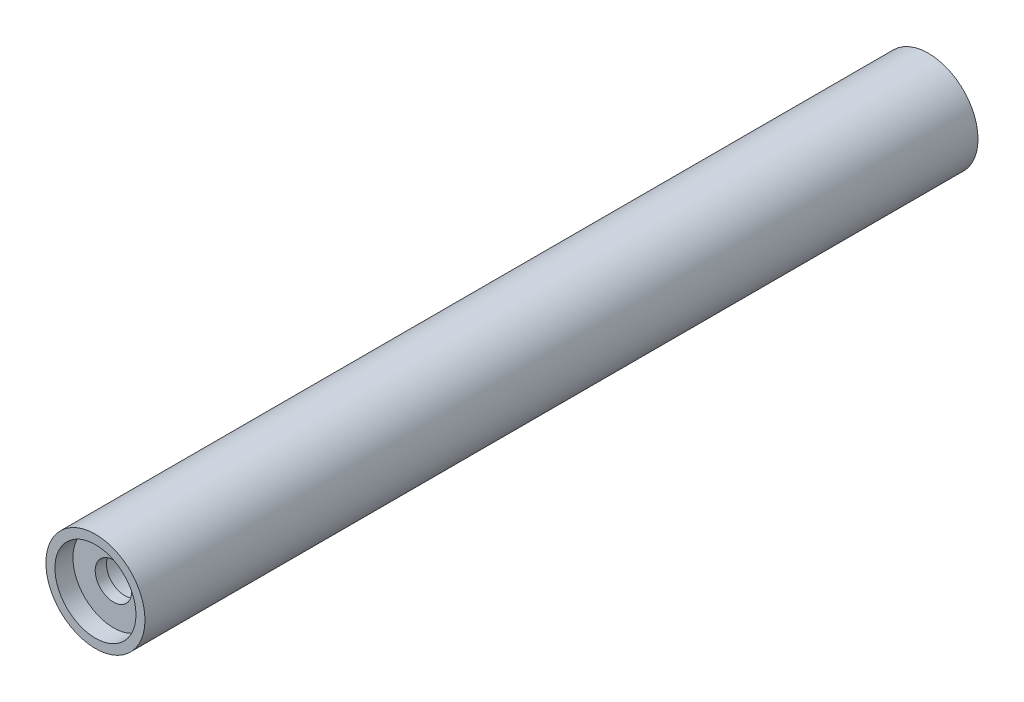
ISO-10303-21;
HEADER;
FILE_DESCRIPTION(('STEP AP214'),'2;1');
FILE_NAME('part.step','',(''),(''),'','','');
FILE_SCHEMA(('AUTOMOTIVE_DESIGN { 1 0 10303 214 1 1 1 1 }'));
ENDSEC;
DATA;
#1=APPLICATION_CONTEXT('core data for automotive mechanical design processes');
#2=APPLICATION_PROTOCOL_DEFINITION('international standard','automotive_design',2000,#1);
#3=PRODUCT_CONTEXT('',#1,'mechanical');
#4=PRODUCT('Part','Part','',(#3));
#5=PRODUCT_RELATED_PRODUCT_CATEGORY('part','',(#4));
#6=PRODUCT_DEFINITION_FORMATION('','',#4);
#7=PRODUCT_DEFINITION_CONTEXT('part definition',#1,'design');
#8=PRODUCT_DEFINITION('design','',#6,#7);
#9=PRODUCT_DEFINITION_SHAPE('','',#8);
#10=(LENGTH_UNIT() NAMED_UNIT(*) SI_UNIT(.MILLI.,.METRE.));
#11=(NAMED_UNIT(*) PLANE_ANGLE_UNIT() SI_UNIT($,.RADIAN.));
#12=(NAMED_UNIT(*) SI_UNIT($,.STERADIAN.) SOLID_ANGLE_UNIT());
#13=UNCERTAINTY_MEASURE_WITH_UNIT(LENGTH_MEASURE(1.E-05),#10,'distance_accuracy_value','');
#14=(GEOMETRIC_REPRESENTATION_CONTEXT(3) GLOBAL_UNCERTAINTY_ASSIGNED_CONTEXT((#13)) GLOBAL_UNIT_ASSIGNED_CONTEXT((#10,
#11,#12)) REPRESENTATION_CONTEXT('',''));
#15=CARTESIAN_POINT('',(0.,0.,0.));
#16=DIRECTION('',(0.,0.,1.));
#17=DIRECTION('',(1.,0.,0.));
#18=AXIS2_PLACEMENT_3D('',#15,#16,#17);
#19=CARTESIAN_POINT('',(0.,0.,92.5));
#20=DIRECTION('',(0.,0.,-1.));
#21=DIRECTION('',(-1.,0.,0.));
#22=AXIS2_PLACEMENT_3D('',#19,#20,#21);
#23=CYLINDRICAL_SURFACE('',#22,2.025);
#24=CARTESIAN_POINT('',(0.,0.,2.));
#25=DIRECTION('',(0.,0.,-1.));
#26=DIRECTION('',(-1.,0.,0.));
#27=AXIS2_PLACEMENT_3D('',#24,#25,#26);
#28=CIRCLE('',#27,2.025);
#29=CARTESIAN_POINT('',(-2.025,0.,2.));
#30=VERTEX_POINT('',#29);
#31=EDGE_CURVE('E59',#30,#30,#28,.T.);
#32=ORIENTED_EDGE('',*,*,#31,.T.);
#33=EDGE_LOOP('',(#32));
#34=FACE_BOUND('',#33,.T.);
#35=CARTESIAN_POINT('',(0.,0.,3.25));
#36=DIRECTION('',(0.,0.,1.));
#37=DIRECTION('',(1.,0.,0.));
#38=AXIS2_PLACEMENT_3D('',#35,#36,#37);
#39=CIRCLE('',#38,2.025);
#40=CARTESIAN_POINT('',(2.025,0.,3.25));
#41=VERTEX_POINT('',#40);
#42=EDGE_CURVE('E41',#41,#41,#39,.T.);
#43=ORIENTED_EDGE('',*,*,#42,.T.);
#44=EDGE_LOOP('',(#43));
#45=FACE_BOUND('',#44,.T.);
#46=ADVANCED_FACE('F37',(#34,#45),#23,.F.);
#47=CARTESIAN_POINT('',(0.,0.,89.25));
#48=DIRECTION('',(0.,0.,1.));
#49=DIRECTION('',(1.,0.,0.));
#50=AXIS2_PLACEMENT_3D('',#47,#48,#49);
#51=CIRCLE('',#50,2.025);
#52=CARTESIAN_POINT('',(2.025,0.,89.25));
#53=VERTEX_POINT('',#52);
#54=EDGE_CURVE('E62',#53,#53,#51,.T.);
#55=ORIENTED_EDGE('',*,*,#54,.F.);
#56=EDGE_LOOP('',(#55));
#57=FACE_BOUND('',#56,.T.);
#58=CARTESIAN_POINT('',(0.,0.,90.5));
#59=DIRECTION('',(0.,0.,1.));
#60=DIRECTION('',(1.,0.,0.));
#61=AXIS2_PLACEMENT_3D('',#58,#59,#60);
#62=CIRCLE('',#61,2.025);
#63=CARTESIAN_POINT('',(2.025,0.,90.5));
#64=VERTEX_POINT('',#63);
#65=EDGE_CURVE('E50',#64,#64,#62,.T.);
#66=ORIENTED_EDGE('',*,*,#65,.T.);
#67=EDGE_LOOP('',(#66));
#68=FACE_BOUND('',#67,.T.);
#69=ADVANCED_FACE('F91',(#57,#68),#23,.F.);
#70=CARTESIAN_POINT('',(0.,0.,92.5));
#71=DIRECTION('',(0.,0.,1.));
#72=DIRECTION('',(1.,0.,0.));
#73=AXIS2_PLACEMENT_3D('',#70,#71,#72);
#74=PLANE('',#73);
#75=CARTESIAN_POINT('',(0.,0.,92.5));
#76=DIRECTION('',(0.,0.,1.));
#77=DIRECTION('',(1.,0.,0.));
#78=AXIS2_PLACEMENT_3D('',#75,#76,#77);
#79=CIRCLE('',#78,4.5);
#80=CARTESIAN_POINT('',(4.5,0.,92.5));
#81=VERTEX_POINT('',#80);
#82=EDGE_CURVE('E53',#81,#81,#79,.T.);
#83=ORIENTED_EDGE('',*,*,#82,.F.);
#84=EDGE_LOOP('',(#83));
#85=FACE_BOUND('',#84,.T.);
#86=CARTESIAN_POINT('',(0.,0.,92.5));
#87=DIRECTION('',(0.,0.,1.));
#88=DIRECTION('',(1.,0.,0.));
#89=AXIS2_PLACEMENT_3D('',#86,#87,#88);
#90=CIRCLE('',#89,5.5);
#91=CARTESIAN_POINT('',(5.5,0.,92.5));
#92=VERTEX_POINT('',#91);
#93=EDGE_CURVE('E10',#92,#92,#90,.T.);
#94=ORIENTED_EDGE('',*,*,#93,.T.);
#95=EDGE_LOOP('',(#94));
#96=FACE_BOUND('',#95,.T.);
#97=ADVANCED_FACE('F88',(#85,#96),#74,.T.);
#98=CARTESIAN_POINT('',(0.,0.,0.));
#99=DIRECTION('',(0.,0.,1.));
#100=DIRECTION('',(1.,0.,0.));
#101=AXIS2_PLACEMENT_3D('',#98,#99,#100);
#102=PLANE('',#101);
#103=CARTESIAN_POINT('',(0.,0.,0.));
#104=DIRECTION('',(0.,0.,-1.));
#105=DIRECTION('',(-1.,0.,0.));
#106=AXIS2_PLACEMENT_3D('',#103,#104,#105);
#107=CIRCLE('',#106,4.5);
#108=CARTESIAN_POINT('',(-4.5,0.,0.));
#109=VERTEX_POINT('',#108);
#110=EDGE_CURVE('E68',#109,#109,#107,.T.);
#111=ORIENTED_EDGE('',*,*,#110,.F.);
#112=EDGE_LOOP('',(#111));
#113=FACE_BOUND('',#112,.T.);
#114=CARTESIAN_POINT('',(0.,0.,0.));
#115=DIRECTION('',(0.,0.,1.));
#116=DIRECTION('',(1.,0.,0.));
#117=AXIS2_PLACEMENT_3D('',#114,#115,#116);
#118=CIRCLE('',#117,5.5);
#119=CARTESIAN_POINT('',(5.5,0.,0.));
#120=VERTEX_POINT('',#119);
#121=EDGE_CURVE('E45',#120,#120,#118,.T.);
#122=ORIENTED_EDGE('',*,*,#121,.F.);
#123=EDGE_LOOP('',(#122));
#124=FACE_BOUND('',#123,.T.);
#125=ADVANCED_FACE('F90',(#113,#124),#102,.F.);
#126=CARTESIAN_POINT('',(0.,0.,92.5));
#127=DIRECTION('',(0.,0.,-1.));
#128=DIRECTION('',(-1.,0.,0.));
#129=AXIS2_PLACEMENT_3D('',#126,#127,#128);
#130=CYLINDRICAL_SURFACE('',#129,5.5);
#131=ORIENTED_EDGE('',*,*,#93,.F.);
#132=EDGE_LOOP('',(#131));
#133=FACE_BOUND('',#132,.T.);
#134=ORIENTED_EDGE('',*,*,#121,.T.);
#135=EDGE_LOOP('',(#134));
#136=FACE_BOUND('',#135,.T.);
#137=ADVANCED_FACE('F39',(#133,#136),#130,.T.);
#138=CARTESIAN_POINT('',(0.,0.,90.5));
#139=DIRECTION('',(0.,0.,1.));
#140=DIRECTION('',(1.,0.,0.));
#141=AXIS2_PLACEMENT_3D('',#138,#139,#140);
#142=CYLINDRICAL_SURFACE('',#141,4.5);
#143=CARTESIAN_POINT('',(0.,0.,90.5));
#144=DIRECTION('',(0.,0.,1.));
#145=DIRECTION('',(1.,0.,0.));
#146=AXIS2_PLACEMENT_3D('',#143,#144,#145);
#147=CIRCLE('',#146,4.5);
#148=CARTESIAN_POINT('',(4.5,0.,90.5));
#149=VERTEX_POINT('',#148);
#150=EDGE_CURVE('E58',#149,#149,#147,.T.);
#151=ORIENTED_EDGE('',*,*,#150,.F.);
#152=EDGE_LOOP('',(#151));
#153=FACE_BOUND('',#152,.T.);
#154=ORIENTED_EDGE('',*,*,#82,.T.);
#155=EDGE_LOOP('',(#154));
#156=FACE_BOUND('',#155,.T.);
#157=ADVANCED_FACE('F86',(#153,#156),#142,.F.);
#158=CARTESIAN_POINT('',(0.,0.,90.5));
#159=DIRECTION('',(0.,0.,1.));
#160=DIRECTION('',(1.,0.,0.));
#161=AXIS2_PLACEMENT_3D('',#158,#159,#160);
#162=PLANE('',#161);
#163=ORIENTED_EDGE('',*,*,#65,.F.);
#164=EDGE_LOOP('',(#163));
#165=FACE_BOUND('',#164,.T.);
#166=ORIENTED_EDGE('',*,*,#150,.T.);
#167=EDGE_LOOP('',(#166));
#168=FACE_BOUND('',#167,.T.);
#169=ADVANCED_FACE('F108',(#165,#168),#162,.T.);
#170=CARTESIAN_POINT('',(0.,0.,2.));
#171=DIRECTION('',(0.,0.,-1.));
#172=DIRECTION('',(-1.,0.,0.));
#173=AXIS2_PLACEMENT_3D('',#170,#171,#172);
#174=CYLINDRICAL_SURFACE('',#173,4.5);
#175=CARTESIAN_POINT('',(0.,0.,2.));
#176=DIRECTION('',(0.,0.,-1.));
#177=DIRECTION('',(-1.,0.,0.));
#178=AXIS2_PLACEMENT_3D('',#175,#176,#177);
#179=CIRCLE('',#178,4.5);
#180=CARTESIAN_POINT('',(-4.5,0.,2.));
#181=VERTEX_POINT('',#180);
#182=EDGE_CURVE('E61',#181,#181,#179,.T.);
#183=ORIENTED_EDGE('',*,*,#182,.F.);
#184=EDGE_LOOP('',(#183));
#185=FACE_BOUND('',#184,.T.);
#186=ORIENTED_EDGE('',*,*,#110,.T.);
#187=EDGE_LOOP('',(#186));
#188=FACE_BOUND('',#187,.T.);
#189=ADVANCED_FACE('F112',(#185,#188),#174,.F.);
#190=CARTESIAN_POINT('',(0.,0.,2.));
#191=DIRECTION('',(0.,0.,-1.));
#192=DIRECTION('',(-1.,0.,0.));
#193=AXIS2_PLACEMENT_3D('',#190,#191,#192);
#194=PLANE('',#193);
#195=ORIENTED_EDGE('',*,*,#31,.F.);
#196=EDGE_LOOP('',(#195));
#197=FACE_BOUND('',#196,.T.);
#198=ORIENTED_EDGE('',*,*,#182,.T.);
#199=EDGE_LOOP('',(#198));
#200=FACE_BOUND('',#199,.T.);
#201=ADVANCED_FACE('F116',(#197,#200),#194,.T.);
#202=CARTESIAN_POINT('',(0.,0.,3.25));
#203=DIRECTION('',(0.,0.,1.));
#204=DIRECTION('',(1.,0.,0.));
#205=AXIS2_PLACEMENT_3D('',#202,#203,#204);
#206=CYLINDRICAL_SURFACE('',#205,3.);
#207=CARTESIAN_POINT('',(0.,0.,3.25));
#208=DIRECTION('',(0.,0.,1.));
#209=DIRECTION('',(1.,0.,0.));
#210=AXIS2_PLACEMENT_3D('',#207,#208,#209);
#211=CIRCLE('',#210,3.);
#212=CARTESIAN_POINT('',(3.,0.,3.25));
#213=VERTEX_POINT('',#212);
#214=EDGE_CURVE('E64',#213,#213,#211,.T.);
#215=ORIENTED_EDGE('',*,*,#214,.F.);
#216=EDGE_LOOP('',(#215));
#217=FACE_BOUND('',#216,.T.);
#218=CARTESIAN_POINT('',(0.,0.,89.25));
#219=DIRECTION('',(0.,0.,1.));
#220=DIRECTION('',(1.,0.,0.));
#221=AXIS2_PLACEMENT_3D('',#218,#219,#220);
#222=CIRCLE('',#221,3.);
#223=CARTESIAN_POINT('',(3.,0.,89.25));
#224=VERTEX_POINT('',#223);
#225=EDGE_CURVE('E70',#224,#224,#222,.T.);
#226=ORIENTED_EDGE('',*,*,#225,.T.);
#227=EDGE_LOOP('',(#226));
#228=FACE_BOUND('',#227,.T.);
#229=ADVANCED_FACE('F120',(#217,#228),#206,.F.);
#230=CARTESIAN_POINT('',(0.,0.,3.25));
#231=DIRECTION('',(0.,0.,1.));
#232=DIRECTION('',(1.,0.,0.));
#233=AXIS2_PLACEMENT_3D('',#230,#231,#232);
#234=PLANE('',#233);
#235=ORIENTED_EDGE('',*,*,#42,.F.);
#236=EDGE_LOOP('',(#235));
#237=FACE_BOUND('',#236,.T.);
#238=ORIENTED_EDGE('',*,*,#214,.T.);
#239=EDGE_LOOP('',(#238));
#240=FACE_BOUND('',#239,.T.);
#241=ADVANCED_FACE('F124',(#237,#240),#234,.T.);
#242=CARTESIAN_POINT('',(0.,0.,89.25));
#243=DIRECTION('',(0.,0.,1.));
#244=DIRECTION('',(1.,0.,0.));
#245=AXIS2_PLACEMENT_3D('',#242,#243,#244);
#246=PLANE('',#245);
#247=ORIENTED_EDGE('',*,*,#54,.T.);
#248=EDGE_LOOP('',(#247));
#249=FACE_BOUND('',#248,.T.);
#250=ORIENTED_EDGE('',*,*,#225,.F.);
#251=EDGE_LOOP('',(#250));
#252=FACE_BOUND('',#251,.T.);
#253=ADVANCED_FACE('F126',(#249,#252),#246,.F.);
#254=CLOSED_SHELL('',(#46,#69,#97,#125,#137,#157,#169,#189,#201,#229,#241,#253));
#255=MANIFOLD_SOLID_BREP('B2',#254);
#256=ADVANCED_BREP_SHAPE_REPRESENTATION('',(#18,#255),#14);
#257=SHAPE_DEFINITION_REPRESENTATION(#9,#256);
ENDSEC;
END-ISO-10303-21;
